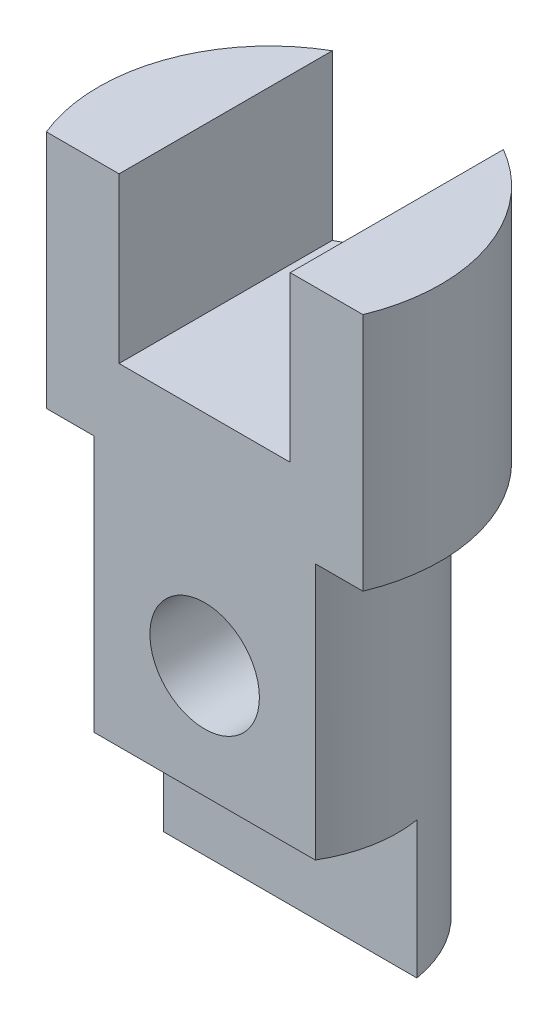
ISO-10303-21;
HEADER;
FILE_DESCRIPTION(('STEP AP214'),'2;1');
FILE_NAME('part.step','',(''),(''),'','','');
FILE_SCHEMA(('AUTOMOTIVE_DESIGN { 1 0 10303 214 1 1 1 1 }'));
ENDSEC;
DATA;
#1=APPLICATION_CONTEXT('core data for automotive mechanical design processes');
#2=APPLICATION_PROTOCOL_DEFINITION('international standard','automotive_design',2000,#1);
#3=PRODUCT_CONTEXT('',#1,'mechanical');
#4=PRODUCT('Part','Part','',(#3));
#5=PRODUCT_RELATED_PRODUCT_CATEGORY('part','',(#4));
#6=PRODUCT_DEFINITION_FORMATION('','',#4);
#7=PRODUCT_DEFINITION_CONTEXT('part definition',#1,'design');
#8=PRODUCT_DEFINITION('design','',#6,#7);
#9=PRODUCT_DEFINITION_SHAPE('','',#8);
#10=(LENGTH_UNIT() NAMED_UNIT(*) SI_UNIT(.MILLI.,.METRE.));
#11=(NAMED_UNIT(*) PLANE_ANGLE_UNIT() SI_UNIT($,.RADIAN.));
#12=(NAMED_UNIT(*) SI_UNIT($,.STERADIAN.) SOLID_ANGLE_UNIT());
#13=UNCERTAINTY_MEASURE_WITH_UNIT(LENGTH_MEASURE(1.E-05),#10,'distance_accuracy_value','');
#14=(GEOMETRIC_REPRESENTATION_CONTEXT(3) GLOBAL_UNCERTAINTY_ASSIGNED_CONTEXT((#13)) GLOBAL_UNIT_ASSIGNED_CONTEXT((#10,
#11,#12)) REPRESENTATION_CONTEXT('',''));
#15=CARTESIAN_POINT('',(0.,0.,0.));
#16=DIRECTION('',(0.,0.,1.));
#17=DIRECTION('',(1.,0.,0.));
#18=AXIS2_PLACEMENT_3D('',#15,#16,#17);
#19=CARTESIAN_POINT('',(0.,70.,0.));
#20=DIRECTION('',(0.,1.,0.));
#21=DIRECTION('',(0.,0.,1.));
#22=AXIS2_PLACEMENT_3D('',#19,#20,#21);
#23=PLANE('',#22);
#24=DIRECTION('',(0.,0.,1.));
#25=VECTOR('',#24,1.);
#26=CARTESIAN_POINT('',(-25.,70.,0.));
#27=LINE('',#26,#25);
#28=CARTESIAN_POINT('',(-25.,70.,-43.3012701892219));
#29=VERTEX_POINT('',#28);
#30=CARTESIAN_POINT('',(-25.,70.,19.));
#31=VERTEX_POINT('',#30);
#32=EDGE_CURVE('E11',#29,#31,#27,.T.);
#33=ORIENTED_EDGE('',*,*,#32,.F.);
#34=CARTESIAN_POINT('',(0.,70.,0.));
#35=DIRECTION('',(0.,1.,0.));
#36=DIRECTION('',(0.,0.,1.));
#37=AXIS2_PLACEMENT_3D('',#34,#35,#36);
#38=CIRCLE('',#37,50.);
#39=CARTESIAN_POINT('',(-46.2493243193887,70.,19.));
#40=VERTEX_POINT('',#39);
#41=EDGE_CURVE('E205',#29,#40,#38,.T.);
#42=ORIENTED_EDGE('',*,*,#41,.T.);
#43=DIRECTION('',(1.,0.,0.));
#44=VECTOR('',#43,1.);
#45=CARTESIAN_POINT('',(-46.2493243193887,70.,19.));
#46=LINE('',#45,#44);
#47=EDGE_CURVE('E206',#40,#31,#46,.T.);
#48=ORIENTED_EDGE('',*,*,#47,.T.);
#49=EDGE_LOOP('',(#33,#42,#48));
#50=FACE_BOUND('',#49,.T.);
#51=ADVANCED_FACE('F42',(#50),#23,.T.);
#52=CARTESIAN_POINT('',(0.,70.,0.));
#53=DIRECTION('',(0.,-1.,0.));
#54=DIRECTION('',(0.,0.,-1.));
#55=AXIS2_PLACEMENT_3D('',#52,#53,#54);
#56=CYLINDRICAL_SURFACE('',#55,50.);
#57=ORIENTED_EDGE('',*,*,#41,.F.);
#58=DIRECTION('',(0.,-1.,0.));
#59=VECTOR('',#58,1.);
#60=CARTESIAN_POINT('',(-25.,70.,-43.3012701892219));
#61=LINE('',#60,#59);
#62=CARTESIAN_POINT('',(-25.,22.,-43.3012701892219));
#63=VERTEX_POINT('',#62);
#64=EDGE_CURVE('E191',#29,#63,#61,.T.);
#65=ORIENTED_EDGE('',*,*,#64,.T.);
#66=CARTESIAN_POINT('',(0.,22.,0.));
#67=DIRECTION('',(0.,-1.,0.));
#68=DIRECTION('',(0.,0.,-1.));
#69=AXIS2_PLACEMENT_3D('',#66,#67,#68);
#70=CIRCLE('',#69,50.);
#71=CARTESIAN_POINT('',(25.,22.,-43.3012701892219));
#72=VERTEX_POINT('',#71);
#73=EDGE_CURVE('E195',#63,#72,#70,.T.);
#74=ORIENTED_EDGE('',*,*,#73,.T.);
#75=DIRECTION('',(0.,-1.,0.));
#76=VECTOR('',#75,1.);
#77=CARTESIAN_POINT('',(25.,70.,-43.3012701892219));
#78=LINE('',#77,#76);
#79=CARTESIAN_POINT('',(25.,70.,-43.3012701892219));
#80=VERTEX_POINT('',#79);
#81=EDGE_CURVE('E184',#72,#80,#78,.F.);
#82=ORIENTED_EDGE('',*,*,#81,.T.);
#83=CARTESIAN_POINT('',(46.2493243193887,70.,19.));
#84=VERTEX_POINT('',#83);
#85=EDGE_CURVE('E200',#84,#80,#38,.T.);
#86=ORIENTED_EDGE('',*,*,#85,.F.);
#87=DIRECTION('',(0.,-1.,0.));
#88=VECTOR('',#87,1.);
#89=CARTESIAN_POINT('',(46.2493243193887,70.,19.));
#90=LINE('',#89,#88);
#91=CARTESIAN_POINT('',(46.2493243193887,0.,19.));
#92=VERTEX_POINT('',#91);
#93=EDGE_CURVE('E210',#84,#92,#90,.T.);
#94=ORIENTED_EDGE('',*,*,#93,.T.);
#95=CARTESIAN_POINT('',(0.,0.,0.));
#96=DIRECTION('',(0.,1.,0.));
#97=DIRECTION('',(0.,0.,1.));
#98=AXIS2_PLACEMENT_3D('',#95,#96,#97);
#99=CIRCLE('',#98,50.);
#100=CARTESIAN_POINT('',(-46.2493243193887,0.,19.));
#101=VERTEX_POINT('',#100);
#102=EDGE_CURVE('E199',#92,#101,#99,.T.);
#103=ORIENTED_EDGE('',*,*,#102,.T.);
#104=DIRECTION('',(0.,-1.,0.));
#105=VECTOR('',#104,1.);
#106=CARTESIAN_POINT('',(-46.2493243193887,70.,19.));
#107=LINE('',#106,#105);
#108=EDGE_CURVE('E57',#40,#101,#107,.T.);
#109=ORIENTED_EDGE('',*,*,#108,.F.);
#110=EDGE_LOOP('',(#57,#65,#74,#82,#86,#94,#103,#109));
#111=FACE_BOUND('',#110,.T.);
#112=ADVANCED_FACE('F44',(#111),#56,.T.);
#113=CARTESIAN_POINT('',(-46.2493243193887,70.,19.));
#114=DIRECTION('',(0.,0.,-1.));
#115=DIRECTION('',(-1.,0.,0.));
#116=AXIS2_PLACEMENT_3D('',#113,#114,#115);
#117=PLANE('',#116);
#118=CARTESIAN_POINT('',(0.,-42.,19.));
#119=DIRECTION('',(0.,0.,1.));
#120=DIRECTION('',(1.,0.,0.));
#121=AXIS2_PLACEMENT_3D('',#118,#119,#120);
#122=CIRCLE('',#121,16.);
#123=CARTESIAN_POINT('',(16.,-42.,19.));
#124=VERTEX_POINT('',#123);
#125=EDGE_CURVE('E242',#124,#124,#122,.T.);
#126=ORIENTED_EDGE('',*,*,#125,.F.);
#127=EDGE_LOOP('',(#126));
#128=FACE_BOUND('',#127,.T.);
#129=DIRECTION('',(1.,0.,0.));
#130=VECTOR('',#129,1.);
#131=CARTESIAN_POINT('',(-25.,22.,19.));
#132=LINE('',#131,#130);
#133=CARTESIAN_POINT('',(-25.,22.,19.));
#134=VERTEX_POINT('',#133);
#135=CARTESIAN_POINT('',(25.,22.,19.));
#136=VERTEX_POINT('',#135);
#137=EDGE_CURVE('E170',#134,#136,#132,.T.);
#138=ORIENTED_EDGE('',*,*,#137,.F.);
#139=DIRECTION('',(0.,1.,0.));
#140=VECTOR('',#139,1.);
#141=CARTESIAN_POINT('',(-25.,22.,19.));
#142=LINE('',#141,#140);
#143=EDGE_CURVE('E178',#134,#31,#142,.T.);
#144=ORIENTED_EDGE('',*,*,#143,.T.);
#145=ORIENTED_EDGE('',*,*,#47,.F.);
#146=ORIENTED_EDGE('',*,*,#108,.T.);
#147=DIRECTION('',(1.,0.,0.));
#148=VECTOR('',#147,1.);
#149=CARTESIAN_POINT('',(-46.2493243193887,0.,19.));
#150=LINE('',#149,#148);
#151=CARTESIAN_POINT('',(-32.3303263206544,0.,19.));
#152=VERTEX_POINT('',#151);
#153=EDGE_CURVE('E215',#101,#152,#150,.T.);
#154=ORIENTED_EDGE('',*,*,#153,.T.);
#155=DIRECTION('',(0.,1.,0.));
#156=VECTOR('',#155,1.);
#157=CARTESIAN_POINT('',(-32.3303263206544,-75.,19.));
#158=LINE('',#157,#156);
#159=CARTESIAN_POINT('',(-32.3303263206544,-75.,19.));
#160=VERTEX_POINT('',#159);
#161=EDGE_CURVE('E157',#160,#152,#158,.T.);
#162=ORIENTED_EDGE('',*,*,#161,.F.);
#163=DIRECTION('',(-1.,0.,0.));
#164=VECTOR('',#163,1.);
#165=CARTESIAN_POINT('',(32.3303263206544,-75.,19.));
#166=LINE('',#165,#164);
#167=CARTESIAN_POINT('',(32.3303263206544,-75.,19.));
#168=VERTEX_POINT('',#167);
#169=EDGE_CURVE('E155',#168,#160,#166,.T.);
#170=ORIENTED_EDGE('',*,*,#169,.F.);
#171=DIRECTION('',(0.,1.,0.));
#172=VECTOR('',#171,1.);
#173=CARTESIAN_POINT('',(32.3303263206544,-75.,19.));
#174=LINE('',#173,#172);
#175=CARTESIAN_POINT('',(32.3303263206544,0.,19.));
#176=VERTEX_POINT('',#175);
#177=EDGE_CURVE('E162',#168,#176,#174,.T.);
#178=ORIENTED_EDGE('',*,*,#177,.T.);
#179=EDGE_CURVE('E214',#176,#92,#150,.T.);
#180=ORIENTED_EDGE('',*,*,#179,.T.);
#181=ORIENTED_EDGE('',*,*,#93,.F.);
#182=CARTESIAN_POINT('',(25.,70.,19.));
#183=VERTEX_POINT('',#182);
#184=EDGE_CURVE('E204',#183,#84,#46,.T.);
#185=ORIENTED_EDGE('',*,*,#184,.F.);
#186=DIRECTION('',(0.,1.,0.));
#187=VECTOR('',#186,1.);
#188=CARTESIAN_POINT('',(25.,22.,19.));
#189=LINE('',#188,#187);
#190=EDGE_CURVE('E181',#136,#183,#189,.T.);
#191=ORIENTED_EDGE('',*,*,#190,.F.);
#192=EDGE_LOOP('',(#138,#144,#145,#146,#154,#162,#170,#178,#180,#181,#185,#191));
#193=FACE_BOUND('',#192,.T.);
#194=ADVANCED_FACE('F227',(#128,#193),#117,.F.);
#195=DIRECTION('',(0.,0.,-1.));
#196=VECTOR('',#195,1.);
#197=CARTESIAN_POINT('',(25.,70.,19.));
#198=LINE('',#197,#196);
#199=EDGE_CURVE('E166',#183,#80,#198,.T.);
#200=ORIENTED_EDGE('',*,*,#199,.F.);
#201=ORIENTED_EDGE('',*,*,#184,.T.);
#202=ORIENTED_EDGE('',*,*,#85,.T.);
#203=EDGE_LOOP('',(#200,#201,#202));
#204=FACE_BOUND('',#203,.T.);
#205=ADVANCED_FACE('F252',(#204),#23,.T.);
#206=CARTESIAN_POINT('',(0.,0.,0.));
#207=DIRECTION('',(0.,1.,0.));
#208=DIRECTION('',(0.,0.,1.));
#209=AXIS2_PLACEMENT_3D('',#206,#207,#208);
#210=PLANE('',#209);
#211=CARTESIAN_POINT('',(0.,0.,0.));
#212=DIRECTION('',(0.,-1.,0.));
#213=DIRECTION('',(0.,0.,-1.));
#214=AXIS2_PLACEMENT_3D('',#211,#212,#213);
#215=CIRCLE('',#214,37.5);
#216=EDGE_CURVE('E72',#152,#176,#215,.T.);
#217=ORIENTED_EDGE('',*,*,#216,.F.);
#218=ORIENTED_EDGE('',*,*,#153,.F.);
#219=ORIENTED_EDGE('',*,*,#102,.F.);
#220=ORIENTED_EDGE('',*,*,#179,.F.);
#221=EDGE_LOOP('',(#217,#218,#219,#220));
#222=FACE_BOUND('',#221,.T.);
#223=ADVANCED_FACE('F234',(#222),#210,.F.);
#224=CARTESIAN_POINT('',(0.,22.,0.));
#225=DIRECTION('',(0.,-1.,0.));
#226=DIRECTION('',(0.,0.,-1.));
#227=AXIS2_PLACEMENT_3D('',#224,#225,#226);
#228=PLANE('',#227);
#229=DIRECTION('',(0.,0.,1.));
#230=VECTOR('',#229,1.);
#231=CARTESIAN_POINT('',(-25.,22.,19.));
#232=LINE('',#231,#230);
#233=EDGE_CURVE('E167',#63,#134,#232,.T.);
#234=ORIENTED_EDGE('',*,*,#233,.T.);
#235=ORIENTED_EDGE('',*,*,#137,.T.);
#236=DIRECTION('',(0.,0.,-1.));
#237=VECTOR('',#236,1.);
#238=CARTESIAN_POINT('',(25.,22.,19.));
#239=LINE('',#238,#237);
#240=EDGE_CURVE('E174',#136,#72,#239,.T.);
#241=ORIENTED_EDGE('',*,*,#240,.T.);
#242=ORIENTED_EDGE('',*,*,#73,.F.);
#243=EDGE_LOOP('',(#234,#235,#241,#242));
#244=FACE_BOUND('',#243,.T.);
#245=ADVANCED_FACE('F269',(#244),#228,.F.);
#246=CARTESIAN_POINT('',(-25.,22.,19.));
#247=DIRECTION('',(-1.,0.,0.));
#248=DIRECTION('',(0.,0.,1.));
#249=AXIS2_PLACEMENT_3D('',#246,#247,#248);
#250=PLANE('',#249);
#251=ORIENTED_EDGE('',*,*,#32,.T.);
#252=ORIENTED_EDGE('',*,*,#143,.F.);
#253=ORIENTED_EDGE('',*,*,#233,.F.);
#254=ORIENTED_EDGE('',*,*,#64,.F.);
#255=EDGE_LOOP('',(#251,#252,#253,#254));
#256=FACE_BOUND('',#255,.T.);
#257=ADVANCED_FACE('F266',(#256),#250,.F.);
#258=CARTESIAN_POINT('',(25.,22.,19.));
#259=DIRECTION('',(1.,0.,0.));
#260=DIRECTION('',(0.,0.,-1.));
#261=AXIS2_PLACEMENT_3D('',#258,#259,#260);
#262=PLANE('',#261);
#263=ORIENTED_EDGE('',*,*,#240,.F.);
#264=ORIENTED_EDGE('',*,*,#190,.T.);
#265=ORIENTED_EDGE('',*,*,#199,.T.);
#266=ORIENTED_EDGE('',*,*,#81,.F.);
#267=EDGE_LOOP('',(#263,#264,#265,#266));
#268=FACE_BOUND('',#267,.T.);
#269=ADVANCED_FACE('F278',(#268),#262,.F.);
#270=CARTESIAN_POINT('',(0.,-75.,0.));
#271=DIRECTION('',(0.,1.,0.));
#272=DIRECTION('',(0.,0.,1.));
#273=AXIS2_PLACEMENT_3D('',#270,#271,#272);
#274=CYLINDRICAL_SURFACE('',#273,37.5);
#275=CARTESIAN_POINT('',(16.,-42.,-33.9153357642232));
#276=CARTESIAN_POINT('',(15.999996829495,-41.5741908124769,-33.9153391537149));
#277=CARTESIAN_POINT('',(15.9829773610557,-41.1482426080005,-33.9233825984036));
#278=CARTESIAN_POINT('',(15.9150757751999,-40.2994630709096,-33.9552900914521));
#279=CARTESIAN_POINT('',(15.8641722401402,-39.8766338808031,-33.9791641460815));
#280=CARTESIAN_POINT('',(15.7289187264385,-39.0364609632936,-34.0419840591702));
#281=CARTESIAN_POINT('',(15.6444900294987,-38.6191325519398,-34.0809653848425));
#282=CARTESIAN_POINT('',(15.4431266941484,-37.7940310560477,-34.1726798398218));
#283=CARTESIAN_POINT('',(15.3261968642208,-37.3862565676932,-34.2254109348043));
#284=CARTESIAN_POINT('',(15.0615486919687,-36.5845399199427,-34.3426933164667));
#285=CARTESIAN_POINT('',(14.9139621915057,-36.1905467048769,-34.4071938477263));
#286=CARTESIAN_POINT('',(14.5889931703314,-35.4168900042294,-34.5462369945573));
#287=CARTESIAN_POINT('',(14.4116096245552,-35.0372270121801,-34.6207799555865));
#288=CARTESIAN_POINT('',(14.0285032882777,-34.2944405148916,-34.7777789454114));
#289=CARTESIAN_POINT('',(13.8227938778734,-33.9313093077742,-34.8602312325866));
#290=CARTESIAN_POINT('',(13.3842776726548,-33.2230604671958,-35.0309360036886));
#291=CARTESIAN_POINT('',(13.1514610060388,-32.877949462943,-35.1191905955476));
#292=CARTESIAN_POINT('',(12.6456341349264,-32.1876774365499,-35.3045988432767));
#293=CARTESIAN_POINT('',(12.3710616967,-31.8437188013048,-35.4019701797244));
#294=CARTESIAN_POINT('',(11.7947545312651,-31.1797865907437,-35.5981236655502));
#295=CARTESIAN_POINT('',(11.4930187184855,-30.8598139749546,-35.6969058711802));
#296=CARTESIAN_POINT('',(10.8638695784822,-30.2454367203207,-35.893383593871));
#297=CARTESIAN_POINT('',(10.5364419898003,-29.9510464760215,-35.9910784725102));
#298=CARTESIAN_POINT('',(9.85791810018436,-29.3898765635278,-36.1828093023862));
#299=CARTESIAN_POINT('',(9.50682998033957,-29.1230874317814,-36.2768465007793));
#300=CARTESIAN_POINT('',(8.76602183677633,-28.6070953016391,-36.4631231140402));
#301=CARTESIAN_POINT('',(8.37526656102762,-28.3592731015192,-36.5550790342166));
#302=CARTESIAN_POINT('',(7.57217198158763,-27.8976339935954,-36.7298389498287));
#303=CARTESIAN_POINT('',(7.15983182805963,-27.6838184260362,-36.8126425845219));
#304=CARTESIAN_POINT('',(6.31646248172129,-27.2922347065464,-36.9666871216482));
#305=CARTESIAN_POINT('',(5.88544010372855,-27.1144535422595,-37.0379321961229));
#306=CARTESIAN_POINT('',(5.00770673014271,-26.7966888512727,-37.1667802692361));
#307=CARTESIAN_POINT('',(4.56099689564641,-26.6567025338472,-37.2243842750759));
#308=CARTESIAN_POINT('',(3.67998443737116,-26.422643030543,-37.3214863959356));
#309=CARTESIAN_POINT('',(3.24632313641944,-26.3264912851696,-37.3617971309604));
#310=CARTESIAN_POINT('',(2.3714018029638,-26.1704744719611,-37.4275147157772));
#311=CARTESIAN_POINT('',(1.93014202251106,-26.1106082028664,-37.452922058957));
#312=CARTESIAN_POINT('',(1.04370659437846,-26.0278754422101,-37.4880962453626));
#313=CARTESIAN_POINT('',(0.598532424159423,-26.0049955463171,-37.4978687548374));
#314=CARTESIAN_POINT('',(-0.292229128095208,-25.9964704514407,-37.5015057645101));
#315=CARTESIAN_POINT('',(-0.737816492429022,-26.0108237248998,-37.4953709173358));
#316=CARTESIAN_POINT('',(-1.59736446059624,-26.0744816523229,-37.468271770907));
#317=CARTESIAN_POINT('',(-2.01152781012717,-26.1214960832342,-37.4482793690218));
#318=CARTESIAN_POINT('',(-2.83407228343762,-26.24750393677,-37.3950246717187));
#319=CARTESIAN_POINT('',(-3.24245370033408,-26.3264957322405,-37.3617630515005));
#320=CARTESIAN_POINT('',(-4.05069568126938,-26.5156806577712,-37.2827945007006));
#321=CARTESIAN_POINT('',(-4.45055595128148,-26.625874862619,-37.2370871414194));
#322=CARTESIAN_POINT('',(-5.23920505603783,-26.8764443792983,-37.1343356742208));
#323=CARTESIAN_POINT('',(-5.62799355268807,-27.0168206116686,-37.0772912205309));
#324=CARTESIAN_POINT('',(-6.39801280560545,-27.3289181301286,-36.9522650813041));
#325=CARTESIAN_POINT('',(-6.77903798201167,-27.5010846519673,-36.8841299135868));
#326=CARTESIAN_POINT('',(-7.52513766199344,-27.8739164983282,-36.739171826731));
#327=CARTESIAN_POINT('',(-7.89021213084305,-28.0745818848907,-36.6623488886798));
#328=CARTESIAN_POINT('',(-8.60254626296212,-28.5030017267954,-36.5017742906687));
#329=CARTESIAN_POINT('',(-8.94980396673312,-28.7307591526343,-36.4180218712354));
#330=CARTESIAN_POINT('',(-9.62488520098556,-29.2119784746355,-36.2454553532978));
#331=CARTESIAN_POINT('',(-9.95270112243682,-29.4654503309537,-36.1566392993387));
#332=CARTESIAN_POINT('',(-10.6104745407122,-30.0160520780618,-35.9693365331463));
#333=CARTESIAN_POINT('',(-10.9388292883422,-30.3150200006505,-35.8706180444692));
#334=CARTESIAN_POINT('',(-11.5694358884813,-30.9390353337379,-35.6722222593625));
#335=CARTESIAN_POINT('',(-11.8716868588794,-31.2640836248412,-35.5725449306579));
#336=CARTESIAN_POINT('',(-12.448483224996,-31.9385769513535,-35.3748251905206));
#337=CARTESIAN_POINT('',(-12.7230189391391,-32.2880304404361,-35.2767833603199));
#338=CARTESIAN_POINT('',(-13.242620155779,-33.009413948166,-35.0850357350014));
#339=CARTESIAN_POINT('',(-13.4876811898543,-33.381347362006,-34.9913305986567));
#340=CARTESIAN_POINT('',(-13.9549070458641,-34.1594725515025,-34.8076982793374));
#341=CARTESIAN_POINT('',(-14.1759233088347,-34.5664168264791,-34.7180302837635));
#342=CARTESIAN_POINT('',(-14.5824808949481,-35.3995464160727,-34.5492360666613));
#343=CARTESIAN_POINT('',(-14.7680379634612,-35.8257230862922,-34.470105170973));
#344=CARTESIAN_POINT('',(-15.1019072346625,-36.6944522675508,-34.3251444748961));
#345=CARTESIAN_POINT('',(-15.2502335648376,-37.1369984936758,-34.259309631078));
#346=CARTESIAN_POINT('',(-15.5080374208716,-38.0352743933739,-34.1433859736276));
#347=CARTESIAN_POINT('',(-15.617518611706,-38.4910028188378,-34.0932956745742));
#348=CARTESIAN_POINT('',(-15.7902548679267,-39.3809672304431,-34.0136188809143));
#349=CARTESIAN_POINT('',(-15.8561174785821,-39.8145951154709,-33.9828826756179));
#350=CARTESIAN_POINT('',(-15.9520368911449,-40.6866457338155,-33.9379632820832));
#351=CARTESIAN_POINT('',(-15.9820953168871,-41.1250682487704,-33.923779343147));
#352=CARTESIAN_POINT('',(-16.0060226650161,-42.0029753360973,-33.912496409405));
#353=CARTESIAN_POINT('',(-15.9999033357866,-42.4424595173659,-33.9153918682257));
#354=CARTESIAN_POINT('',(-15.9515803579082,-43.3189858472751,-33.9381466527865));
#355=CARTESIAN_POINT('',(-15.9093779014691,-43.7560280761192,-33.958005418048));
#356=CARTESIAN_POINT('',(-15.7935500088262,-44.5942893241053,-34.0120202591729));
#357=CARTESIAN_POINT('',(-15.7222822464209,-44.9959068679531,-34.0451005049066));
#358=CARTESIAN_POINT('',(-15.5496554470656,-45.7912805388887,-34.1242908148143));
#359=CARTESIAN_POINT('',(-15.4482980766242,-46.1850371000671,-34.1704001573668));
#360=CARTESIAN_POINT('',(-15.2164270849615,-46.9623467212756,-34.2742828410697));
#361=CARTESIAN_POINT('',(-15.0859083897352,-47.3458979925952,-34.3320582119141));
#362=CARTESIAN_POINT('',(-14.7968288414011,-48.1005868641982,-34.457635896839));
#363=CARTESIAN_POINT('',(-14.638266621819,-48.471723858524,-34.5254386994988));
#364=CARTESIAN_POINT('',(-14.2868754082679,-49.215367127332,-34.6723663364174));
#365=CARTESIAN_POINT('',(-14.0928640562659,-49.5872429798556,-34.7518532008877));
#366=CARTESIAN_POINT('',(-13.6769515563891,-50.3136167727347,-34.9176332393316));
#367=CARTESIAN_POINT('',(-13.4550408963287,-50.6681087285284,-35.0039287309312));
#368=CARTESIAN_POINT('',(-12.9847242077397,-51.357950775672,-35.1811040128504));
#369=CARTESIAN_POINT('',(-12.7363126569435,-51.6932968549579,-35.2719847565592));
#370=CARTESIAN_POINT('',(-12.21441561068,-52.3431988196156,-35.456094242657));
#371=CARTESIAN_POINT('',(-11.9409287758261,-52.6577535928817,-35.549323110277));
#372=CARTESIAN_POINT('',(-11.3455974736179,-53.290799619326,-35.7440031064964));
#373=CARTESIAN_POINT('',(-11.0216164383124,-53.6072811434681,-35.8454684223433));
#374=CARTESIAN_POINT('',(-10.3476616747444,-54.2119118097388,-36.0457963665768));
#375=CARTESIAN_POINT('',(-9.9976959665638,-54.5000696305982,-36.1446597853751));
#376=CARTESIAN_POINT('',(-9.27352706438545,-55.0463579651948,-36.3371997583833));
#377=CARTESIAN_POINT('',(-8.8993164204139,-55.3044791805179,-36.4308747017221));
#378=CARTESIAN_POINT('',(-8.12893186076076,-55.7886705159521,-36.6104749604789));
#379=CARTESIAN_POINT('',(-7.73275841505902,-56.0147413215389,-36.6964004416236));
#380=CARTESIAN_POINT('',(-6.91901240488183,-56.4339074354633,-36.8585152008953));
#381=CARTESIAN_POINT('',(-6.501349626023,-56.6268459539601,-36.9346577785432));
#382=CARTESIAN_POINT('',(-5.64914012919949,-56.9766267934703,-37.0745686645689));
#383=CARTESIAN_POINT('',(-5.2145931846672,-57.1334686299087,-37.1383368068261));
#384=CARTESIAN_POINT('',(-4.33206789169109,-57.4093089510552,-37.2515903497987));
#385=CARTESIAN_POINT('',(-3.88409658994333,-57.528326922234,-37.3010831038305));
#386=CARTESIAN_POINT('',(-2.97812046894288,-57.7272322160086,-37.3843236169516));
#387=CARTESIAN_POINT('',(-2.52011645122818,-57.8071226527721,-37.418072629078));
#388=CARTESIAN_POINT('',(-1.63153946704375,-57.9224359793158,-37.466938361467));
#389=CARTESIAN_POINT('',(-1.201393897177,-57.9606702122432,-37.4832316088505));
#390=CARTESIAN_POINT('',(-0.339122860917874,-58.002227155185,-37.5009454428578));
#391=CARTESIAN_POINT('',(0.0930025030110205,-58.0055516519687,-37.5023667906633));
#392=CARTESIAN_POINT('',(0.955818377208147,-57.9772558352337,-37.4902993492071));
#393=CARTESIAN_POINT('',(1.38650911988573,-57.9456414886331,-37.4768131058903));
#394=CARTESIAN_POINT('',(2.24323078194979,-57.8478324996735,-37.4353019907032));
#395=CARTESIAN_POINT('',(2.66926173867569,-57.7816381346158,-37.4072772354189));
#396=CARTESIAN_POINT('',(3.4971797788167,-57.6186050665394,-37.3387946540815));
#397=CARTESIAN_POINT('',(3.89936382027722,-57.5230487862973,-37.2988588776959));
#398=CARTESIAN_POINT('',(4.69387861403971,-57.3015547710096,-37.2072226490157));
#399=CARTESIAN_POINT('',(5.08620970609402,-57.1756180851429,-37.1555226030004));
#400=CARTESIAN_POINT('',(5.85869027414051,-56.8944528233435,-37.0415741358402));
#401=CARTESIAN_POINT('',(6.23883826054441,-56.7392206814147,-36.9793244306297));
#402=CARTESIAN_POINT('',(6.98477465081988,-56.4007186042463,-36.8457123900376));
#403=CARTESIAN_POINT('',(7.35056245173541,-56.2174474932844,-36.7743496725525));
#404=CARTESIAN_POINT('',(8.08216379076861,-55.8152353282079,-36.6206858384722));
#405=CARTESIAN_POINT('',(8.44721959650333,-55.5950497781937,-36.5380345457042));
#406=CARTESIAN_POINT('',(9.15760433006323,-55.1270417289395,-36.3664932596129));
#407=CARTESIAN_POINT('',(9.50293278913807,-54.8792185734026,-36.2776031181572));
#408=CARTESIAN_POINT('',(10.1721641335692,-54.3574721979072,-36.0956693044542));
#409=CARTESIAN_POINT('',(10.4960646696221,-54.0835461240986,-36.0026251786413));
#410=CARTESIAN_POINT('',(11.1209478304973,-53.5110458542049,-35.8145369110208));
#411=CARTESIAN_POINT('',(11.4219195947773,-53.2124601155543,-35.7194918483118));
#412=CARTESIAN_POINT('',(12.0200764596392,-52.5699582372123,-35.5228642306499));
#413=CARTESIAN_POINT('',(12.3154288408674,-52.2243261849471,-35.4213036658842));
#414=CARTESIAN_POINT('',(12.8759424550613,-51.5087630882257,-35.221422868595));
#415=CARTESIAN_POINT('',(13.1411164794055,-51.1388424443507,-35.1231012758537));
#416=CARTESIAN_POINT('',(13.6398463589904,-50.3762947114135,-34.9324483226054));
#417=CARTESIAN_POINT('',(13.8733740022074,-49.9836478015856,-34.8401223447368));
#418=CARTESIAN_POINT('',(14.3067010526515,-49.1782574186035,-34.6644341239003));
#419=CARTESIAN_POINT('',(14.5065027886256,-48.7655153355425,-34.5810712621808));
#420=CARTESIAN_POINT('',(14.8701663419808,-47.9235079540871,-34.4262566881633));
#421=CARTESIAN_POINT('',(15.0341124045073,-47.4942842342945,-34.3547771522186));
#422=CARTESIAN_POINT('',(15.3249941741285,-46.6212803934361,-34.2260120512007));
#423=CARTESIAN_POINT('',(15.4519233991839,-46.1774977380651,-34.1687289723405));
#424=CARTESIAN_POINT('',(15.6669136851236,-45.2802485858478,-34.0706876320196));
#425=CARTESIAN_POINT('',(15.7550899066938,-44.8268150369326,-34.0298804396561));
#426=CARTESIAN_POINT('',(15.891931868881,-43.9130175631775,-33.966193070191));
#427=CARTESIAN_POINT('',(15.9406279591272,-43.452659239468,-33.9432991230833));
#428=CARTESIAN_POINT('',(15.9795179371719,-42.8260505407215,-33.9249918646579));
#429=CARTESIAN_POINT('',(15.9871962228515,-42.6609632056554,-33.9213735883698));
#430=CARTESIAN_POINT('',(15.9974379075639,-42.3305908994777,-33.9165448623941));
#431=CARTESIAN_POINT('',(16.0000012308407,-42.1653059254751,-33.9153344483685));
#432=CARTESIAN_POINT('',(16.,-42.,-33.9153357642232));
#433=B_SPLINE_CURVE_WITH_KNOTS('',3,(#275,#276,#277,#278,#279,#280,#281,#282,#283,#284,#285,
#286,#287,#288,#289,#290,#291,#292,#293,#294,#295,#296,#297,#298,#299,#300,#301,#302,#303,#304,
#305,#306,#307,#308,#309,#310,#311,#312,#313,#314,#315,#316,#317,#318,#319,#320,#321,#322,#323,
#324,#325,#326,#327,#328,#329,#330,#331,#332,#333,#334,#335,#336,#337,#338,#339,#340,#341,#342,
#343,#344,#345,#346,#347,#348,#349,#350,#351,#352,#353,#354,#355,#356,#357,#358,#359,#360,#361,
#362,#363,#364,#365,#366,#367,#368,#369,#370,#371,#372,#373,#374,#375,#376,#377,#378,#379,#380,
#381,#382,#383,#384,#385,#386,#387,#388,#389,#390,#391,#392,#393,#394,#395,#396,#397,#398,#399,
#400,#401,#402,#403,#404,#405,#406,#407,#408,#409,#410,#411,#412,#413,#414,#415,#416,#417,#418,
#419,#420,#421,#422,#423,#424,#425,#426,#427,#428,#429,#430,#431,#432),.UNSPECIFIED.,.T.,.F.,(4,
2,2,2,2,2,2,2,2,2,2,2,2,2,2,2,2,2,2,2,2,2,2,2,2,2,2,2,2,2,2,2,2,2,2,2,2,2,2,2,2,2,2,2,2,2,2,2,2,
2,2,2,2,2,2,2,2,2,2,2,2,2,2,2,2,2,2,2,2,2,2,2,2,2,2,2,2,2,4),(0.,1.27725566381997,
2.55531943062575,3.83640205298367,5.11729524231226,6.39278983449068,7.66832831465942,
8.94326633113198,10.2186701098017,11.5694482415782,12.9202803805297,14.271867742031,
15.622990140187,17.0364983524265,18.450062259028,19.8631148016241,21.2760629775824,
22.6123697244894,23.9486322294748,25.2844103472949,26.6201336632934,27.8705688065723,
29.1209403300062,30.3713549285476,31.6218076696102,32.8913238052091,34.1608427045059,
35.4305009282661,36.7006528293103,38.0638628092915,39.4271188374971,40.7908494463897,
42.1547865397173,43.5680504299375,44.9806853060079,46.3927833339074,47.8047480972148,
49.1220281604175,50.4392484784572,51.7560410651567,53.0727901458621,54.2990880251431,
55.5253179987648,56.7517615000314,57.9782647785725,59.2576307546021,60.5374341156038,
61.8175046854643,63.0976436696722,64.488429869716,65.8787885785327,67.2695765612443,
68.6603347940981,70.0575031656766,71.454690292254,72.8511564309235,74.2475114065244,
75.5423175135026,76.8370573486805,78.1315761000455,79.4260844706675,80.6705913523906,
81.9150552615676,83.1596707512241,84.4043384440734,85.7056995268163,87.0070915189332,
88.3086259567336,89.6107731007043,91.0066704716624,92.4019739573639,93.7985132543133,
95.1949560818664,96.5880817652424,97.9814512533576,99.370651655013,100.758783118965,
101.25462681782,101.750477860406),.UNSPECIFIED.);
#434=CARTESIAN_POINT('',(16.,-42.,-33.9153357642232));
#435=VERTEX_POINT('',#434);
#436=EDGE_CURVE('E46',#435,#435,#433,.T.);
#437=ORIENTED_EDGE('',*,*,#436,.T.);
#438=EDGE_LOOP('',(#437));
#439=FACE_BOUND('',#438,.T.);
#440=ORIENTED_EDGE('',*,*,#216,.T.);
#441=ORIENTED_EDGE('',*,*,#177,.F.);
#442=CARTESIAN_POINT('',(0.,-75.,0.));
#443=DIRECTION('',(0.,-1.,0.));
#444=DIRECTION('',(0.,0.,-1.));
#445=AXIS2_PLACEMENT_3D('',#442,#443,#444);
#446=CIRCLE('',#445,37.5);
#447=CARTESIAN_POINT('',(37.0168880377592,-75.,-6.));
#448=VERTEX_POINT('',#447);
#449=EDGE_CURVE('E143',#448,#168,#446,.T.);
#450=ORIENTED_EDGE('',*,*,#449,.F.);
#451=DIRECTION('',(0.,1.,0.));
#452=VECTOR('',#451,1.);
#453=CARTESIAN_POINT('',(37.0168880377592,-115.,-6.));
#454=LINE('',#453,#452);
#455=CARTESIAN_POINT('',(37.0168880377592,-115.,-6.));
#456=VERTEX_POINT('',#455);
#457=EDGE_CURVE('E129',#456,#448,#454,.T.);
#458=ORIENTED_EDGE('',*,*,#457,.F.);
#459=CARTESIAN_POINT('',(0.,-115.,0.));
#460=DIRECTION('',(0.,-1.,0.));
#461=DIRECTION('',(0.,0.,-1.));
#462=AXIS2_PLACEMENT_3D('',#459,#460,#461);
#463=CIRCLE('',#462,37.5);
#464=CARTESIAN_POINT('',(-37.0168880377592,-115.,-6.));
#465=VERTEX_POINT('',#464);
#466=EDGE_CURVE('E135',#465,#456,#463,.T.);
#467=ORIENTED_EDGE('',*,*,#466,.F.);
#468=DIRECTION('',(0.,1.,0.));
#469=VECTOR('',#468,1.);
#470=CARTESIAN_POINT('',(-37.0168880377592,-115.,-6.));
#471=LINE('',#470,#469);
#472=CARTESIAN_POINT('',(-37.0168880377592,-75.,-6.));
#473=VERTEX_POINT('',#472);
#474=EDGE_CURVE('E131',#465,#473,#471,.T.);
#475=ORIENTED_EDGE('',*,*,#474,.T.);
#476=EDGE_CURVE('E152',#160,#473,#446,.T.);
#477=ORIENTED_EDGE('',*,*,#476,.F.);
#478=ORIENTED_EDGE('',*,*,#161,.T.);
#479=EDGE_LOOP('',(#440,#441,#450,#458,#467,#475,#477,#478));
#480=FACE_BOUND('',#479,.T.);
#481=ADVANCED_FACE('F141',(#439,#480),#274,.T.);
#482=CARTESIAN_POINT('',(0.,-75.,0.));
#483=DIRECTION('',(0.,-1.,0.));
#484=DIRECTION('',(0.,0.,-1.));
#485=AXIS2_PLACEMENT_3D('',#482,#483,#484);
#486=PLANE('',#485);
#487=DIRECTION('',(-1.,0.,0.));
#488=VECTOR('',#487,1.);
#489=CARTESIAN_POINT('',(-37.0168880377592,-75.,-6.));
#490=LINE('',#489,#488);
#491=EDGE_CURVE('E64',#448,#473,#490,.T.);
#492=ORIENTED_EDGE('',*,*,#491,.F.);
#493=ORIENTED_EDGE('',*,*,#449,.T.);
#494=ORIENTED_EDGE('',*,*,#169,.T.);
#495=ORIENTED_EDGE('',*,*,#476,.T.);
#496=EDGE_LOOP('',(#492,#493,#494,#495));
#497=FACE_BOUND('',#496,.T.);
#498=ADVANCED_FACE('F238',(#497),#486,.T.);
#499=CARTESIAN_POINT('',(-37.0168880377592,-115.,-6.));
#500=DIRECTION('',(0.,0.,-1.));
#501=DIRECTION('',(-1.,0.,0.));
#502=AXIS2_PLACEMENT_3D('',#499,#500,#501);
#503=PLANE('',#502);
#504=ORIENTED_EDGE('',*,*,#491,.T.);
#505=ORIENTED_EDGE('',*,*,#474,.F.);
#506=DIRECTION('',(-1.,0.,0.));
#507=VECTOR('',#506,1.);
#508=CARTESIAN_POINT('',(-37.0168880377592,-115.,-6.));
#509=LINE('',#508,#507);
#510=EDGE_CURVE('E125',#456,#465,#509,.T.);
#511=ORIENTED_EDGE('',*,*,#510,.F.);
#512=ORIENTED_EDGE('',*,*,#457,.T.);
#513=EDGE_LOOP('',(#504,#505,#511,#512));
#514=FACE_BOUND('',#513,.T.);
#515=ADVANCED_FACE('F127',(#514),#503,.F.);
#516=CARTESIAN_POINT('',(0.,-115.,0.));
#517=DIRECTION('',(0.,-1.,0.));
#518=DIRECTION('',(0.,0.,-1.));
#519=AXIS2_PLACEMENT_3D('',#516,#517,#518);
#520=PLANE('',#519);
#521=ORIENTED_EDGE('',*,*,#466,.T.);
#522=ORIENTED_EDGE('',*,*,#510,.T.);
#523=EDGE_LOOP('',(#521,#522));
#524=FACE_BOUND('',#523,.T.);
#525=ADVANCED_FACE('F137',(#524),#520,.T.);
#526=CARTESIAN_POINT('',(0.,-42.,-50.));
#527=DIRECTION('',(0.,0.,1.));
#528=DIRECTION('',(1.,0.,0.));
#529=AXIS2_PLACEMENT_3D('',#526,#527,#528);
#530=CYLINDRICAL_SURFACE('',#529,16.);
#531=ORIENTED_EDGE('',*,*,#125,.T.);
#532=EDGE_LOOP('',(#531));
#533=FACE_BOUND('',#532,.T.);
#534=ORIENTED_EDGE('',*,*,#436,.F.);
#535=EDGE_LOOP('',(#534));
#536=FACE_BOUND('',#535,.T.);
#537=ADVANCED_FACE('F248',(#533,#536),#530,.F.);
#538=CLOSED_SHELL('',(#51,#112,#194,#205,#223,#245,#257,#269,#481,#498,#515,#525,#537));
#539=MANIFOLD_SOLID_BREP('B2',#538);
#540=ADVANCED_BREP_SHAPE_REPRESENTATION('',(#18,#539),#14);
#541=SHAPE_DEFINITION_REPRESENTATION(#9,#540);
ENDSEC;
END-ISO-10303-21;
